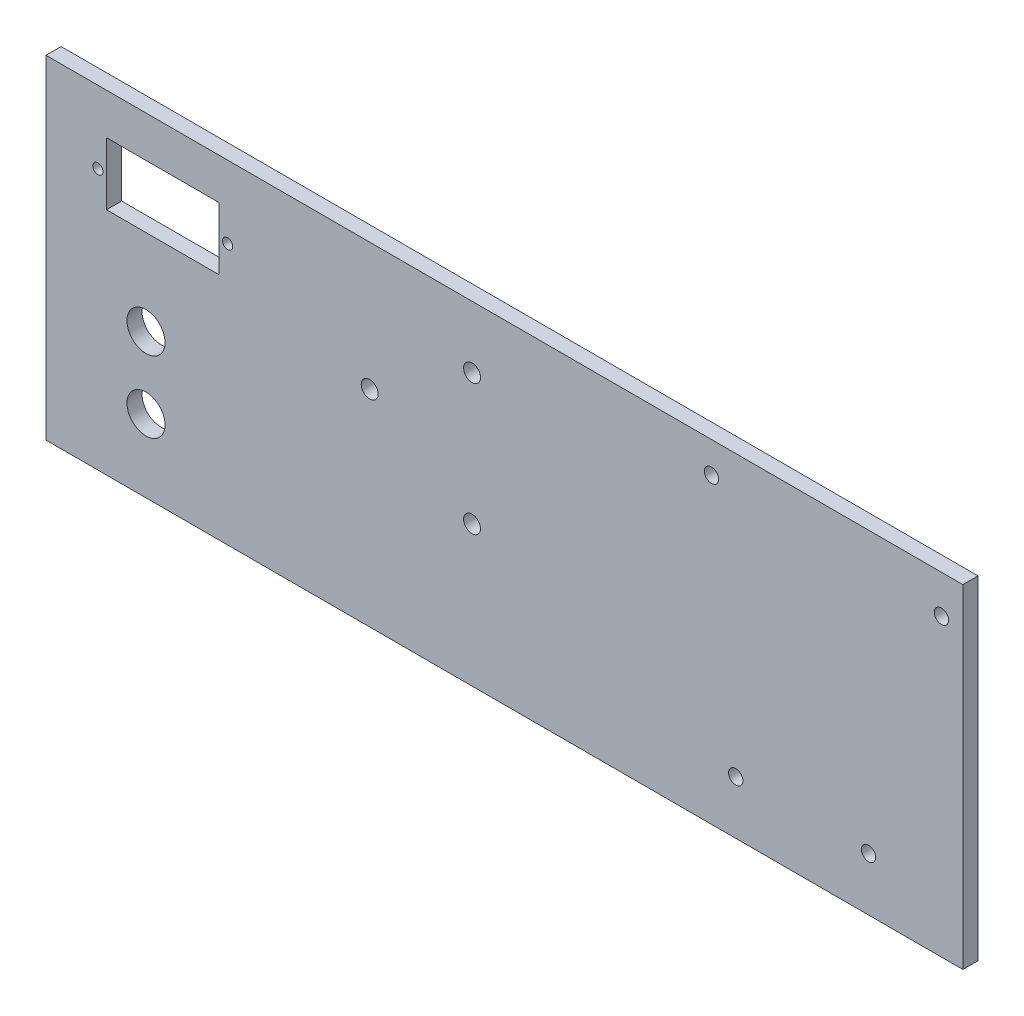
ISO-10303-21;
HEADER;
FILE_DESCRIPTION(('STEP AP214'),'2;1');
FILE_NAME('part.step','',(''),(''),'','','');
FILE_SCHEMA(('AUTOMOTIVE_DESIGN { 1 0 10303 214 1 1 1 1 }'));
ENDSEC;
DATA;
#1=APPLICATION_CONTEXT('core data for automotive mechanical design processes');
#2=APPLICATION_PROTOCOL_DEFINITION('international standard','automotive_design',2000,#1);
#3=PRODUCT_CONTEXT('',#1,'mechanical');
#4=PRODUCT('Part','Part','',(#3));
#5=PRODUCT_RELATED_PRODUCT_CATEGORY('part','',(#4));
#6=PRODUCT_DEFINITION_FORMATION('','',#4);
#7=PRODUCT_DEFINITION_CONTEXT('part definition',#1,'design');
#8=PRODUCT_DEFINITION('design','',#6,#7);
#9=PRODUCT_DEFINITION_SHAPE('','',#8);
#10=(LENGTH_UNIT() NAMED_UNIT(*) SI_UNIT(.MILLI.,.METRE.));
#11=(NAMED_UNIT(*) PLANE_ANGLE_UNIT() SI_UNIT($,.RADIAN.));
#12=(NAMED_UNIT(*) SI_UNIT($,.STERADIAN.) SOLID_ANGLE_UNIT());
#13=UNCERTAINTY_MEASURE_WITH_UNIT(LENGTH_MEASURE(1.E-05),#10,'distance_accuracy_value','');
#14=(GEOMETRIC_REPRESENTATION_CONTEXT(3) GLOBAL_UNCERTAINTY_ASSIGNED_CONTEXT((#13)) GLOBAL_UNIT_ASSIGNED_CONTEXT((#10,
#11,#12)) REPRESENTATION_CONTEXT('',''));
#15=CARTESIAN_POINT('',(0.,0.,0.));
#16=DIRECTION('',(0.,0.,1.));
#17=DIRECTION('',(1.,0.,0.));
#18=AXIS2_PLACEMENT_3D('',#15,#16,#17);
#19=CARTESIAN_POINT('',(63.7856191475757,70.,-73.));
#20=DIRECTION('',(0.,1.,0.));
#21=DIRECTION('',(1.,0.,0.));
#22=AXIS2_PLACEMENT_3D('',#19,#20,#21);
#23=PLANE('',#22);
#24=DIRECTION('',(1.,0.,0.));
#25=VECTOR('',#24,1.);
#26=CARTESIAN_POINT('',(63.7856191475757,70.,-73.));
#27=LINE('',#26,#25);
#28=CARTESIAN_POINT('',(0.,70.,-72.9999999999998));
#29=VERTEX_POINT('',#28);
#30=CARTESIAN_POINT('',(192.571238295151,70.,-73.0000000000004));
#31=VERTEX_POINT('',#30);
#32=EDGE_CURVE('E55',#29,#31,#27,.T.);
#33=ORIENTED_EDGE('',*,*,#32,.F.);
#34=DIRECTION('',(0.,0.,-1.));
#35=VECTOR('',#34,1.);
#36=CARTESIAN_POINT('',(0.,70.,-72.9999999999998));
#37=LINE('',#36,#35);
#38=CARTESIAN_POINT('',(0.,70.,-69.8199999999998));
#39=VERTEX_POINT('',#38);
#40=EDGE_CURVE('E190',#39,#29,#37,.T.);
#41=ORIENTED_EDGE('',*,*,#40,.F.);
#42=DIRECTION('',(-1.,0.,0.));
#43=VECTOR('',#42,1.);
#44=CARTESIAN_POINT('',(63.7856191475757,70.,-69.82));
#45=LINE('',#44,#43);
#46=CARTESIAN_POINT('',(192.571238295151,70.,-69.8200000000004));
#47=VERTEX_POINT('',#46);
#48=EDGE_CURVE('E82',#39,#47,#45,.F.);
#49=ORIENTED_EDGE('',*,*,#48,.T.);
#50=DIRECTION('',(0.,0.,-1.));
#51=VECTOR('',#50,1.);
#52=CARTESIAN_POINT('',(192.571238295151,70.,-73.0000000000004));
#53=LINE('',#52,#51);
#54=EDGE_CURVE('E205',#47,#31,#53,.T.);
#55=ORIENTED_EDGE('',*,*,#54,.T.);
#56=EDGE_LOOP('',(#33,#41,#49,#55));
#57=FACE_BOUND('',#56,.T.);
#58=ADVANCED_FACE('F45',(#57),#23,.T.);
#59=CARTESIAN_POINT('',(63.7856191475757,0.,-73.));
#60=DIRECTION('',(0.,1.,0.));
#61=DIRECTION('',(1.,0.,0.));
#62=AXIS2_PLACEMENT_3D('',#59,#60,#61);
#63=PLANE('',#62);
#64=DIRECTION('',(-1.,0.,0.));
#65=VECTOR('',#64,1.);
#66=CARTESIAN_POINT('',(63.7856191475757,0.,-69.82));
#67=LINE('',#66,#65);
#68=CARTESIAN_POINT('',(0.,0.,-69.8199999999998));
#69=VERTEX_POINT('',#68);
#70=CARTESIAN_POINT('',(192.571238295151,0.,-69.8200000000004));
#71=VERTEX_POINT('',#70);
#72=EDGE_CURVE('E12',#69,#71,#67,.F.);
#73=ORIENTED_EDGE('',*,*,#72,.F.);
#74=DIRECTION('',(0.,0.,-1.));
#75=VECTOR('',#74,1.);
#76=CARTESIAN_POINT('',(0.,0.,-72.9999999999998));
#77=LINE('',#76,#75);
#78=CARTESIAN_POINT('',(0.,0.,-72.9999999999998));
#79=VERTEX_POINT('',#78);
#80=EDGE_CURVE('E116',#69,#79,#77,.T.);
#81=ORIENTED_EDGE('',*,*,#80,.T.);
#82=DIRECTION('',(1.,0.,0.));
#83=VECTOR('',#82,1.);
#84=CARTESIAN_POINT('',(63.7856191475757,0.,-73.));
#85=LINE('',#84,#83);
#86=CARTESIAN_POINT('',(192.571238295151,0.,-73.0000000000004));
#87=VERTEX_POINT('',#86);
#88=EDGE_CURVE('E74',#79,#87,#85,.T.);
#89=ORIENTED_EDGE('',*,*,#88,.T.);
#90=DIRECTION('',(0.,0.,-1.));
#91=VECTOR('',#90,1.);
#92=CARTESIAN_POINT('',(192.571238295151,0.,-73.0000000000004));
#93=LINE('',#92,#91);
#94=EDGE_CURVE('E118',#71,#87,#93,.T.);
#95=ORIENTED_EDGE('',*,*,#94,.F.);
#96=EDGE_LOOP('',(#73,#81,#89,#95));
#97=FACE_BOUND('',#96,.T.);
#98=ADVANCED_FACE('F115',(#97),#63,.F.);
#99=CARTESIAN_POINT('',(0.,70.,-72.9999999999998));
#100=DIRECTION('',(0.,0.,-1.));
#101=DIRECTION('',(-1.,0.,0.));
#102=AXIS2_PLACEMENT_3D('',#99,#100,#101);
#103=PLANE('',#102);
#104=CARTESIAN_POINT('',(67.9856191475758,43.25,-73.));
#105=DIRECTION('',(0.,0.,-1.));
#106=DIRECTION('',(-1.,0.,0.));
#107=AXIS2_PLACEMENT_3D('',#104,#105,#106);
#108=CIRCLE('',#107,1.77799999999999);
#109=CARTESIAN_POINT('',(66.2076191475759,43.25,-73.));
#110=VERTEX_POINT('',#109);
#111=EDGE_CURVE('E223',#110,#110,#108,.T.);
#112=ORIENTED_EDGE('',*,*,#111,.F.);
#113=EDGE_LOOP('',(#112));
#114=FACE_BOUND('',#113,.T.);
#115=CARTESIAN_POINT('',(89.4856191475758,57.,-73.0000000000001));
#116=DIRECTION('',(0.,0.,-1.));
#117=DIRECTION('',(-1.,0.,0.));
#118=AXIS2_PLACEMENT_3D('',#115,#116,#117);
#119=CIRCLE('',#118,1.77799999999999);
#120=CARTESIAN_POINT('',(87.7076191475758,57.,-73.0000000000001));
#121=VERTEX_POINT('',#120);
#122=EDGE_CURVE('E227',#121,#121,#119,.T.);
#123=ORIENTED_EDGE('',*,*,#122,.F.);
#124=EDGE_LOOP('',(#123));
#125=FACE_BOUND('',#124,.T.);
#126=CARTESIAN_POINT('',(89.4856191475758,29.5,-73.0000000000001));
#127=DIRECTION('',(0.,0.,-1.));
#128=DIRECTION('',(-1.,0.,0.));
#129=AXIS2_PLACEMENT_3D('',#126,#127,#128);
#130=CIRCLE('',#129,1.778);
#131=CARTESIAN_POINT('',(87.7076191475758,29.5,-73.0000000000001));
#132=VERTEX_POINT('',#131);
#133=EDGE_CURVE('E195',#132,#132,#130,.T.);
#134=ORIENTED_EDGE('',*,*,#133,.F.);
#135=EDGE_LOOP('',(#134));
#136=FACE_BOUND('',#135,.T.);
#137=ORIENTED_EDGE('',*,*,#88,.F.);
#138=DIRECTION('',(0.,-1.,0.));
#139=VECTOR('',#138,1.);
#140=CARTESIAN_POINT('',(0.,70.,-72.9999999999998));
#141=LINE('',#140,#139);
#142=EDGE_CURVE('E125',#29,#79,#141,.T.);
#143=ORIENTED_EDGE('',*,*,#142,.F.);
#144=ORIENTED_EDGE('',*,*,#32,.T.);
#145=DIRECTION('',(0.,-1.,0.));
#146=VECTOR('',#145,1.);
#147=CARTESIAN_POINT('',(192.571238295151,70.,-73.0000000000004));
#148=LINE('',#147,#146);
#149=EDGE_CURVE('E207',#31,#87,#148,.T.);
#150=ORIENTED_EDGE('',*,*,#149,.T.);
#151=EDGE_LOOP('',(#137,#143,#144,#150));
#152=FACE_BOUND('',#151,.T.);
#153=CARTESIAN_POINT('',(188.071238295151,62.,-73.0000000000004));
#154=DIRECTION('',(0.,0.,-1.));
#155=DIRECTION('',(-1.,0.,0.));
#156=AXIS2_PLACEMENT_3D('',#153,#154,#155);
#157=CIRCLE('',#156,1.5);
#158=CARTESIAN_POINT('',(186.571238295151,62.,-73.0000000000004));
#159=VERTEX_POINT('',#158);
#160=EDGE_CURVE('E210',#159,#159,#157,.T.);
#161=ORIENTED_EDGE('',*,*,#160,.F.);
#162=EDGE_LOOP('',(#161));
#163=FACE_BOUND('',#162,.T.);
#164=CARTESIAN_POINT('',(144.871238295151,11.2,-73.0000000000003));
#165=DIRECTION('',(0.,0.,-1.));
#166=DIRECTION('',(-1.,0.,0.));
#167=AXIS2_PLACEMENT_3D('',#164,#165,#166);
#168=CIRCLE('',#167,1.5);
#169=CARTESIAN_POINT('',(143.371238295151,11.2,-73.0000000000003));
#170=VERTEX_POINT('',#169);
#171=EDGE_CURVE('E213',#170,#170,#168,.T.);
#172=ORIENTED_EDGE('',*,*,#171,.F.);
#173=EDGE_LOOP('',(#172));
#174=FACE_BOUND('',#173,.T.);
#175=CARTESIAN_POINT('',(139.771238295151,63.5,-73.0000000000003));
#176=DIRECTION('',(0.,0.,-1.));
#177=DIRECTION('',(-1.,0.,0.));
#178=AXIS2_PLACEMENT_3D('',#175,#176,#177);
#179=CIRCLE('',#178,1.5);
#180=CARTESIAN_POINT('',(138.271238295151,63.5,-73.0000000000003));
#181=VERTEX_POINT('',#180);
#182=EDGE_CURVE('E216',#181,#181,#179,.T.);
#183=ORIENTED_EDGE('',*,*,#182,.F.);
#184=EDGE_LOOP('',(#183));
#185=FACE_BOUND('',#184,.T.);
#186=CARTESIAN_POINT('',(172.771238295151,11.2,-73.0000000000004));
#187=DIRECTION('',(0.,0.,-1.));
#188=DIRECTION('',(-1.,0.,0.));
#189=AXIS2_PLACEMENT_3D('',#186,#187,#188);
#190=CIRCLE('',#189,1.5);
#191=CARTESIAN_POINT('',(171.271238295151,11.2,-73.0000000000004));
#192=VERTEX_POINT('',#191);
#193=EDGE_CURVE('E219',#192,#192,#190,.T.);
#194=ORIENTED_EDGE('',*,*,#193,.F.);
#195=EDGE_LOOP('',(#194));
#196=FACE_BOUND('',#195,.T.);
#197=CARTESIAN_POINT('',(38.1430257973656,54.8143121186807,-72.9999999999999));
#198=DIRECTION('',(0.,0.,-1.));
#199=DIRECTION('',(-1.,0.,0.));
#200=AXIS2_PLACEMENT_3D('',#197,#198,#199);
#201=CIRCLE('',#200,1.075);
#202=CARTESIAN_POINT('',(37.0680257973656,54.8143121186807,-72.9999999999999));
#203=VERTEX_POINT('',#202);
#204=EDGE_CURVE('E127',#203,#203,#201,.T.);
#205=ORIENTED_EDGE('',*,*,#204,.F.);
#206=EDGE_LOOP('',(#205));
#207=FACE_BOUND('',#206,.T.);
#208=CARTESIAN_POINT('',(10.8930257973656,54.8143121186807,-72.9999999999998));
#209=DIRECTION('',(0.,0.,-1.));
#210=DIRECTION('',(-1.,0.,0.));
#211=AXIS2_PLACEMENT_3D('',#208,#209,#210);
#212=CIRCLE('',#211,1.075);
#213=CARTESIAN_POINT('',(9.81802579736561,54.8143121186807,-72.9999999999998));
#214=VERTEX_POINT('',#213);
#215=EDGE_CURVE('E160',#214,#214,#212,.T.);
#216=ORIENTED_EDGE('',*,*,#215,.F.);
#217=EDGE_LOOP('',(#216));
#218=FACE_BOUND('',#217,.T.);
#219=DIRECTION('',(1.,0.,0.));
#220=VECTOR('',#219,1.);
#221=CARTESIAN_POINT('',(12.7060257973656,61.3763121186807,-72.9999999999999));
#222=LINE('',#221,#220);
#223=CARTESIAN_POINT('',(12.7060257973656,61.3763121186807,-72.9999999999999));
#224=VERTEX_POINT('',#223);
#225=CARTESIAN_POINT('',(36.3300257973656,61.3763121186807,-72.9999999999999));
#226=VERTEX_POINT('',#225);
#227=EDGE_CURVE('E163',#224,#226,#222,.T.);
#228=ORIENTED_EDGE('',*,*,#227,.F.);
#229=DIRECTION('',(0.,1.,0.));
#230=VECTOR('',#229,1.);
#231=CARTESIAN_POINT('',(12.7060257973656,61.3763121186807,-72.9999999999999));
#232=LINE('',#231,#230);
#233=CARTESIAN_POINT('',(12.7060257973656,48.2523121186807,-72.9999999999999));
#234=VERTEX_POINT('',#233);
#235=EDGE_CURVE('E167',#234,#224,#232,.T.);
#236=ORIENTED_EDGE('',*,*,#235,.F.);
#237=DIRECTION('',(-1.,0.,0.));
#238=VECTOR('',#237,1.);
#239=CARTESIAN_POINT('',(12.7060257973656,48.2523121186807,-72.9999999999999));
#240=LINE('',#239,#238);
#241=CARTESIAN_POINT('',(36.3300257973656,48.2523121186807,-72.9999999999999));
#242=VERTEX_POINT('',#241);
#243=EDGE_CURVE('E172',#242,#234,#240,.T.);
#244=ORIENTED_EDGE('',*,*,#243,.F.);
#245=DIRECTION('',(0.,-1.,0.));
#246=VECTOR('',#245,1.);
#247=CARTESIAN_POINT('',(36.3300257973656,61.3763121186807,-72.9999999999999));
#248=LINE('',#247,#246);
#249=EDGE_CURVE('E177',#226,#242,#248,.T.);
#250=ORIENTED_EDGE('',*,*,#249,.F.);
#251=EDGE_LOOP('',(#228,#236,#244,#250));
#252=FACE_BOUND('',#251,.T.);
#253=CARTESIAN_POINT('',(21.,15.25,-72.9999999999999));
#254=DIRECTION('',(0.,0.,-1.));
#255=DIRECTION('',(-1.,0.,0.));
#256=AXIS2_PLACEMENT_3D('',#253,#254,#255);
#257=CIRCLE('',#256,4.);
#258=CARTESIAN_POINT('',(17.,15.25,-72.9999999999999));
#259=VERTEX_POINT('',#258);
#260=EDGE_CURVE('E183',#259,#259,#257,.T.);
#261=ORIENTED_EDGE('',*,*,#260,.F.);
#262=EDGE_LOOP('',(#261));
#263=FACE_BOUND('',#262,.T.);
#264=CARTESIAN_POINT('',(21.0000007040894,30.25,-72.9999999999999));
#265=DIRECTION('',(0.,0.,-1.));
#266=DIRECTION('',(-1.,0.,0.));
#267=AXIS2_PLACEMENT_3D('',#264,#265,#266);
#268=CIRCLE('',#267,4.);
#269=CARTESIAN_POINT('',(17.0000007040894,30.25,-72.9999999999999));
#270=VERTEX_POINT('',#269);
#271=EDGE_CURVE('E186',#270,#270,#268,.T.);
#272=ORIENTED_EDGE('',*,*,#271,.F.);
#273=EDGE_LOOP('',(#272));
#274=FACE_BOUND('',#273,.T.);
#275=ADVANCED_FACE('F47',(#114,#125,#136,#152,#163,#174,#185,#196,#207,#218,#252,#263,#274),
#103,.T.);
#276=CARTESIAN_POINT('',(63.7856191475757,70.,-69.82));
#277=DIRECTION('',(0.,0.,-1.));
#278=DIRECTION('',(-1.,0.,0.));
#279=AXIS2_PLACEMENT_3D('',#276,#277,#278);
#280=PLANE('',#279);
#281=CARTESIAN_POINT('',(67.9856191475758,43.25,-69.82));
#282=DIRECTION('',(0.,0.,-1.));
#283=DIRECTION('',(-1.,0.,0.));
#284=AXIS2_PLACEMENT_3D('',#281,#282,#283);
#285=CIRCLE('',#284,1.77799999999999);
#286=CARTESIAN_POINT('',(66.2076191475759,43.25,-69.82));
#287=VERTEX_POINT('',#286);
#288=EDGE_CURVE('E49',#287,#287,#285,.T.);
#289=ORIENTED_EDGE('',*,*,#288,.T.);
#290=EDGE_LOOP('',(#289));
#291=FACE_BOUND('',#290,.T.);
#292=CARTESIAN_POINT('',(89.4856191475758,57.,-69.8200000000001));
#293=DIRECTION('',(0.,0.,-1.));
#294=DIRECTION('',(-1.,0.,0.));
#295=AXIS2_PLACEMENT_3D('',#292,#293,#294);
#296=CIRCLE('',#295,1.77799999999999);
#297=CARTESIAN_POINT('',(87.7076191475759,57.,-69.8200000000001));
#298=VERTEX_POINT('',#297);
#299=EDGE_CURVE('E236',#298,#298,#296,.T.);
#300=ORIENTED_EDGE('',*,*,#299,.T.);
#301=EDGE_LOOP('',(#300));
#302=FACE_BOUND('',#301,.T.);
#303=CARTESIAN_POINT('',(89.4856191475758,29.5,-69.8200000000001));
#304=DIRECTION('',(0.,0.,-1.));
#305=DIRECTION('',(-1.,0.,0.));
#306=AXIS2_PLACEMENT_3D('',#303,#304,#305);
#307=CIRCLE('',#306,1.778);
#308=CARTESIAN_POINT('',(87.7076191475758,29.5,-69.8200000000001));
#309=VERTEX_POINT('',#308);
#310=EDGE_CURVE('E226',#309,#309,#307,.T.);
#311=ORIENTED_EDGE('',*,*,#310,.T.);
#312=EDGE_LOOP('',(#311));
#313=FACE_BOUND('',#312,.T.);
#314=ORIENTED_EDGE('',*,*,#72,.T.);
#315=DIRECTION('',(0.,1.,0.));
#316=VECTOR('',#315,1.);
#317=CARTESIAN_POINT('',(192.571238295151,70.,-69.8200000000004));
#318=LINE('',#317,#316);
#319=EDGE_CURVE('E131',#47,#71,#318,.F.);
#320=ORIENTED_EDGE('',*,*,#319,.F.);
#321=ORIENTED_EDGE('',*,*,#48,.F.);
#322=DIRECTION('',(0.,1.,0.));
#323=VECTOR('',#322,1.);
#324=CARTESIAN_POINT('',(0.,70.,-69.8199999999998));
#325=LINE('',#324,#323);
#326=EDGE_CURVE('E123',#39,#69,#325,.F.);
#327=ORIENTED_EDGE('',*,*,#326,.T.);
#328=EDGE_LOOP('',(#314,#320,#321,#327));
#329=FACE_BOUND('',#328,.T.);
#330=CARTESIAN_POINT('',(188.071238295151,62.,-69.8200000000004));
#331=DIRECTION('',(0.,0.,-1.));
#332=DIRECTION('',(-1.,0.,0.));
#333=AXIS2_PLACEMENT_3D('',#330,#331,#332);
#334=CIRCLE('',#333,1.5);
#335=CARTESIAN_POINT('',(186.571238295151,62.,-69.8200000000004));
#336=VERTEX_POINT('',#335);
#337=EDGE_CURVE('E202',#336,#336,#334,.T.);
#338=ORIENTED_EDGE('',*,*,#337,.T.);
#339=EDGE_LOOP('',(#338));
#340=FACE_BOUND('',#339,.T.);
#341=CARTESIAN_POINT('',(144.871238295151,11.2,-69.8200000000003));
#342=DIRECTION('',(0.,0.,-1.));
#343=DIRECTION('',(-1.,0.,0.));
#344=AXIS2_PLACEMENT_3D('',#341,#342,#343);
#345=CIRCLE('',#344,1.5);
#346=CARTESIAN_POINT('',(143.371238295151,11.2,-69.8200000000003));
#347=VERTEX_POINT('',#346);
#348=EDGE_CURVE('E199',#347,#347,#345,.T.);
#349=ORIENTED_EDGE('',*,*,#348,.T.);
#350=EDGE_LOOP('',(#349));
#351=FACE_BOUND('',#350,.T.);
#352=CARTESIAN_POINT('',(139.771238295151,63.5,-69.8200000000003));
#353=DIRECTION('',(0.,0.,-1.));
#354=DIRECTION('',(-1.,0.,0.));
#355=AXIS2_PLACEMENT_3D('',#352,#353,#354);
#356=CIRCLE('',#355,1.5);
#357=CARTESIAN_POINT('',(138.271238295151,63.5,-69.8200000000003));
#358=VERTEX_POINT('',#357);
#359=EDGE_CURVE('E196',#358,#358,#356,.T.);
#360=ORIENTED_EDGE('',*,*,#359,.T.);
#361=EDGE_LOOP('',(#360));
#362=FACE_BOUND('',#361,.T.);
#363=CARTESIAN_POINT('',(172.771238295151,11.2,-69.8200000000003));
#364=DIRECTION('',(0.,0.,-1.));
#365=DIRECTION('',(-1.,0.,0.));
#366=AXIS2_PLACEMENT_3D('',#363,#364,#365);
#367=CIRCLE('',#366,1.5);
#368=CARTESIAN_POINT('',(171.271238295151,11.2,-69.8200000000003));
#369=VERTEX_POINT('',#368);
#370=EDGE_CURVE('E192',#369,#369,#367,.T.);
#371=ORIENTED_EDGE('',*,*,#370,.T.);
#372=EDGE_LOOP('',(#371));
#373=FACE_BOUND('',#372,.T.);
#374=CARTESIAN_POINT('',(38.1430257973656,54.8143121186807,-69.8199999999999));
#375=DIRECTION('',(0.,0.,-1.));
#376=DIRECTION('',(-1.,0.,0.));
#377=AXIS2_PLACEMENT_3D('',#374,#375,#376);
#378=CIRCLE('',#377,1.075);
#379=CARTESIAN_POINT('',(37.0680257973656,54.8143121186807,-69.8199999999999));
#380=VERTEX_POINT('',#379);
#381=EDGE_CURVE('E126',#380,#380,#378,.T.);
#382=ORIENTED_EDGE('',*,*,#381,.T.);
#383=EDGE_LOOP('',(#382));
#384=FACE_BOUND('',#383,.T.);
#385=CARTESIAN_POINT('',(10.8930257973656,54.8143121186807,-69.8199999999998));
#386=DIRECTION('',(0.,0.,-1.));
#387=DIRECTION('',(-1.,0.,0.));
#388=AXIS2_PLACEMENT_3D('',#385,#386,#387);
#389=CIRCLE('',#388,1.075);
#390=CARTESIAN_POINT('',(9.81802579736562,54.8143121186807,-69.8199999999998));
#391=VERTEX_POINT('',#390);
#392=EDGE_CURVE('E153',#391,#391,#389,.T.);
#393=ORIENTED_EDGE('',*,*,#392,.T.);
#394=EDGE_LOOP('',(#393));
#395=FACE_BOUND('',#394,.T.);
#396=DIRECTION('',(0.,1.,0.));
#397=VECTOR('',#396,1.);
#398=CARTESIAN_POINT('',(12.7060257973656,70.,-69.8199999999999));
#399=LINE('',#398,#397);
#400=CARTESIAN_POINT('',(12.7060257973656,48.2523121186807,-69.8199999999999));
#401=VERTEX_POINT('',#400);
#402=CARTESIAN_POINT('',(12.7060257973656,61.3763121186807,-69.8199999999999));
#403=VERTEX_POINT('',#402);
#404=EDGE_CURVE('E150',#401,#403,#399,.T.);
#405=ORIENTED_EDGE('',*,*,#404,.T.);
#406=DIRECTION('',(1.,0.,0.));
#407=VECTOR('',#406,1.);
#408=CARTESIAN_POINT('',(0.,61.3763121186807,-69.8199999999998));
#409=LINE('',#408,#407);
#410=CARTESIAN_POINT('',(36.3300257973656,61.3763121186807,-69.8199999999999));
#411=VERTEX_POINT('',#410);
#412=EDGE_CURVE('E147',#403,#411,#409,.T.);
#413=ORIENTED_EDGE('',*,*,#412,.T.);
#414=DIRECTION('',(0.,-1.,0.));
#415=VECTOR('',#414,1.);
#416=CARTESIAN_POINT('',(36.3300257973656,70.,-69.8199999999999));
#417=LINE('',#416,#415);
#418=CARTESIAN_POINT('',(36.3300257973656,48.2523121186807,-69.8199999999999));
#419=VERTEX_POINT('',#418);
#420=EDGE_CURVE('E144',#411,#419,#417,.T.);
#421=ORIENTED_EDGE('',*,*,#420,.T.);
#422=DIRECTION('',(-1.,0.,0.));
#423=VECTOR('',#422,1.);
#424=CARTESIAN_POINT('',(0.,48.2523121186807,-69.8199999999998));
#425=LINE('',#424,#423);
#426=EDGE_CURVE('E141',#419,#401,#425,.T.);
#427=ORIENTED_EDGE('',*,*,#426,.T.);
#428=EDGE_LOOP('',(#405,#413,#421,#427));
#429=FACE_BOUND('',#428,.T.);
#430=CARTESIAN_POINT('',(21.,15.25,-69.8199999999999));
#431=DIRECTION('',(0.,0.,-1.));
#432=DIRECTION('',(-1.,0.,0.));
#433=AXIS2_PLACEMENT_3D('',#430,#431,#432);
#434=CIRCLE('',#433,4.);
#435=CARTESIAN_POINT('',(17.,15.25,-69.8199999999999));
#436=VERTEX_POINT('',#435);
#437=EDGE_CURVE('E136',#436,#436,#434,.T.);
#438=ORIENTED_EDGE('',*,*,#437,.T.);
#439=EDGE_LOOP('',(#438));
#440=FACE_BOUND('',#439,.T.);
#441=CARTESIAN_POINT('',(21.0000007040894,30.25,-69.8199999999999));
#442=DIRECTION('',(0.,0.,-1.));
#443=DIRECTION('',(-1.,0.,0.));
#444=AXIS2_PLACEMENT_3D('',#441,#442,#443);
#445=CIRCLE('',#444,4.);
#446=CARTESIAN_POINT('',(17.0000007040894,30.25,-69.8199999999999));
#447=VERTEX_POINT('',#446);
#448=EDGE_CURVE('E132',#447,#447,#445,.T.);
#449=ORIENTED_EDGE('',*,*,#448,.T.);
#450=EDGE_LOOP('',(#449));
#451=FACE_BOUND('',#450,.T.);
#452=ADVANCED_FACE('F129',(#291,#302,#313,#329,#340,#351,#362,#373,#384,#395,#429,#440,#451),
#280,.F.);
#453=CARTESIAN_POINT('',(89.4856191475759,29.5,-63.0000000000001));
#454=DIRECTION('',(0.,0.,-1.));
#455=DIRECTION('',(-1.,0.,0.));
#456=AXIS2_PLACEMENT_3D('',#453,#454,#455);
#457=CYLINDRICAL_SURFACE('',#456,1.778);
#458=ORIENTED_EDGE('',*,*,#133,.T.);
#459=EDGE_LOOP('',(#458));
#460=FACE_BOUND('',#459,.T.);
#461=ORIENTED_EDGE('',*,*,#310,.F.);
#462=EDGE_LOOP('',(#461));
#463=FACE_BOUND('',#462,.T.);
#464=ADVANCED_FACE('F257',(#460,#463),#457,.F.);
#465=CARTESIAN_POINT('',(89.4856191475759,57.,-63.0000000000001));
#466=DIRECTION('',(0.,0.,-1.));
#467=DIRECTION('',(-1.,0.,0.));
#468=AXIS2_PLACEMENT_3D('',#465,#466,#467);
#469=CYLINDRICAL_SURFACE('',#468,1.77799999999999);
#470=ORIENTED_EDGE('',*,*,#122,.T.);
#471=EDGE_LOOP('',(#470));
#472=FACE_BOUND('',#471,.T.);
#473=ORIENTED_EDGE('',*,*,#299,.F.);
#474=EDGE_LOOP('',(#473));
#475=FACE_BOUND('',#474,.T.);
#476=ADVANCED_FACE('F247',(#472,#475),#469,.F.);
#477=CARTESIAN_POINT('',(67.9856191475759,43.25,-63.));
#478=DIRECTION('',(0.,0.,-1.));
#479=DIRECTION('',(-1.,0.,0.));
#480=AXIS2_PLACEMENT_3D('',#477,#478,#479);
#481=CYLINDRICAL_SURFACE('',#480,1.77799999999999);
#482=ORIENTED_EDGE('',*,*,#111,.T.);
#483=EDGE_LOOP('',(#482));
#484=FACE_BOUND('',#483,.T.);
#485=ORIENTED_EDGE('',*,*,#288,.F.);
#486=EDGE_LOOP('',(#485));
#487=FACE_BOUND('',#486,.T.);
#488=ADVANCED_FACE('F244',(#484,#487),#481,.F.);
#489=CARTESIAN_POINT('',(192.571238295151,70.,-73.0000000000004));
#490=DIRECTION('',(1.,0.,0.));
#491=DIRECTION('',(0.,-1.,0.));
#492=AXIS2_PLACEMENT_3D('',#489,#490,#491);
#493=PLANE('',#492);
#494=ORIENTED_EDGE('',*,*,#54,.F.);
#495=ORIENTED_EDGE('',*,*,#319,.T.);
#496=ORIENTED_EDGE('',*,*,#94,.T.);
#497=ORIENTED_EDGE('',*,*,#149,.F.);
#498=EDGE_LOOP('',(#494,#495,#496,#497));
#499=FACE_BOUND('',#498,.T.);
#500=ADVANCED_FACE('F246',(#499),#493,.T.);
#501=CARTESIAN_POINT('',(172.771238295151,11.2,-73.0000000000004));
#502=DIRECTION('',(0.,0.,-1.));
#503=DIRECTION('',(-1.,0.,0.));
#504=AXIS2_PLACEMENT_3D('',#501,#502,#503);
#505=CYLINDRICAL_SURFACE('',#504,1.5);
#506=ORIENTED_EDGE('',*,*,#193,.T.);
#507=EDGE_LOOP('',(#506));
#508=FACE_BOUND('',#507,.T.);
#509=ORIENTED_EDGE('',*,*,#370,.F.);
#510=EDGE_LOOP('',(#509));
#511=FACE_BOUND('',#510,.T.);
#512=ADVANCED_FACE('F254',(#508,#511),#505,.F.);
#513=CARTESIAN_POINT('',(139.771238295151,63.5,-73.0000000000003));
#514=DIRECTION('',(0.,0.,-1.));
#515=DIRECTION('',(-1.,0.,0.));
#516=AXIS2_PLACEMENT_3D('',#513,#514,#515);
#517=CYLINDRICAL_SURFACE('',#516,1.5);
#518=ORIENTED_EDGE('',*,*,#182,.T.);
#519=EDGE_LOOP('',(#518));
#520=FACE_BOUND('',#519,.T.);
#521=ORIENTED_EDGE('',*,*,#359,.F.);
#522=EDGE_LOOP('',(#521));
#523=FACE_BOUND('',#522,.T.);
#524=ADVANCED_FACE('F346',(#520,#523),#517,.F.);
#525=CARTESIAN_POINT('',(144.871238295151,11.2,-73.0000000000003));
#526=DIRECTION('',(0.,0.,-1.));
#527=DIRECTION('',(-1.,0.,0.));
#528=AXIS2_PLACEMENT_3D('',#525,#526,#527);
#529=CYLINDRICAL_SURFACE('',#528,1.5);
#530=ORIENTED_EDGE('',*,*,#171,.T.);
#531=EDGE_LOOP('',(#530));
#532=FACE_BOUND('',#531,.T.);
#533=ORIENTED_EDGE('',*,*,#348,.F.);
#534=EDGE_LOOP('',(#533));
#535=FACE_BOUND('',#534,.T.);
#536=ADVANCED_FACE('F350',(#532,#535),#529,.F.);
#537=CARTESIAN_POINT('',(188.071238295151,62.,-73.0000000000004));
#538=DIRECTION('',(0.,0.,-1.));
#539=DIRECTION('',(-1.,0.,0.));
#540=AXIS2_PLACEMENT_3D('',#537,#538,#539);
#541=CYLINDRICAL_SURFACE('',#540,1.5);
#542=ORIENTED_EDGE('',*,*,#160,.T.);
#543=EDGE_LOOP('',(#542));
#544=FACE_BOUND('',#543,.T.);
#545=ORIENTED_EDGE('',*,*,#337,.F.);
#546=EDGE_LOOP('',(#545));
#547=FACE_BOUND('',#546,.T.);
#548=ADVANCED_FACE('F318',(#544,#547),#541,.F.);
#549=CARTESIAN_POINT('',(0.,70.,-72.9999999999998));
#550=DIRECTION('',(1.,0.,0.));
#551=DIRECTION('',(0.,-1.,0.));
#552=AXIS2_PLACEMENT_3D('',#549,#550,#551);
#553=PLANE('',#552);
#554=ORIENTED_EDGE('',*,*,#80,.F.);
#555=ORIENTED_EDGE('',*,*,#326,.F.);
#556=ORIENTED_EDGE('',*,*,#40,.T.);
#557=ORIENTED_EDGE('',*,*,#142,.T.);
#558=EDGE_LOOP('',(#554,#555,#556,#557));
#559=FACE_BOUND('',#558,.T.);
#560=ADVANCED_FACE('F122',(#559),#553,.F.);
#561=CARTESIAN_POINT('',(21.0000007040894,30.25,-62.9999999999999));
#562=DIRECTION('',(0.,0.,-1.));
#563=DIRECTION('',(-1.,0.,0.));
#564=AXIS2_PLACEMENT_3D('',#561,#562,#563);
#565=CYLINDRICAL_SURFACE('',#564,4.);
#566=ORIENTED_EDGE('',*,*,#271,.T.);
#567=EDGE_LOOP('',(#566));
#568=FACE_BOUND('',#567,.T.);
#569=ORIENTED_EDGE('',*,*,#448,.F.);
#570=EDGE_LOOP('',(#569));
#571=FACE_BOUND('',#570,.T.);
#572=ADVANCED_FACE('F304',(#568,#571),#565,.F.);
#573=CARTESIAN_POINT('',(21.,15.25,-62.9999999999999));
#574=DIRECTION('',(0.,0.,-1.));
#575=DIRECTION('',(-1.,0.,0.));
#576=AXIS2_PLACEMENT_3D('',#573,#574,#575);
#577=CYLINDRICAL_SURFACE('',#576,4.);
#578=ORIENTED_EDGE('',*,*,#260,.T.);
#579=EDGE_LOOP('',(#578));
#580=FACE_BOUND('',#579,.T.);
#581=ORIENTED_EDGE('',*,*,#437,.F.);
#582=EDGE_LOOP('',(#581));
#583=FACE_BOUND('',#582,.T.);
#584=ADVANCED_FACE('F307',(#580,#583),#577,.F.);
#585=CARTESIAN_POINT('',(36.3300257973656,61.3763121186807,-62.9999999999999));
#586=DIRECTION('',(1.,0.,0.));
#587=DIRECTION('',(0.,0.,-1.));
#588=AXIS2_PLACEMENT_3D('',#585,#586,#587);
#589=PLANE('',#588);
#590=DIRECTION('',(0.,0.,-1.));
#591=VECTOR('',#590,1.);
#592=CARTESIAN_POINT('',(36.3300257973656,61.3763121186807,-62.9999999999999));
#593=LINE('',#592,#591);
#594=EDGE_CURVE('E180',#411,#226,#593,.T.);
#595=ORIENTED_EDGE('',*,*,#594,.T.);
#596=ORIENTED_EDGE('',*,*,#249,.T.);
#597=DIRECTION('',(0.,0.,-1.));
#598=VECTOR('',#597,1.);
#599=CARTESIAN_POINT('',(36.3300257973656,48.2523121186807,-62.9999999999999));
#600=LINE('',#599,#598);
#601=EDGE_CURVE('E175',#419,#242,#600,.T.);
#602=ORIENTED_EDGE('',*,*,#601,.F.);
#603=ORIENTED_EDGE('',*,*,#420,.F.);
#604=EDGE_LOOP('',(#595,#596,#602,#603));
#605=FACE_BOUND('',#604,.T.);
#606=ADVANCED_FACE('F315',(#605),#589,.F.);
#607=CARTESIAN_POINT('',(12.7060257973657,48.2523121186807,-62.9999999999999));
#608=DIRECTION('',(0.,-1.,0.));
#609=DIRECTION('',(0.,0.,-1.));
#610=AXIS2_PLACEMENT_3D('',#607,#608,#609);
#611=PLANE('',#610);
#612=ORIENTED_EDGE('',*,*,#601,.T.);
#613=ORIENTED_EDGE('',*,*,#243,.T.);
#614=DIRECTION('',(0.,0.,-1.));
#615=VECTOR('',#614,1.);
#616=CARTESIAN_POINT('',(12.7060257973657,48.2523121186807,-62.9999999999999));
#617=LINE('',#616,#615);
#618=EDGE_CURVE('E170',#401,#234,#617,.T.);
#619=ORIENTED_EDGE('',*,*,#618,.F.);
#620=ORIENTED_EDGE('',*,*,#426,.F.);
#621=EDGE_LOOP('',(#612,#613,#619,#620));
#622=FACE_BOUND('',#621,.T.);
#623=ADVANCED_FACE('F323',(#622),#611,.F.);
#624=CARTESIAN_POINT('',(12.7060257973657,61.3763121186807,-62.9999999999999));
#625=DIRECTION('',(-1.,0.,0.));
#626=DIRECTION('',(0.,0.,1.));
#627=AXIS2_PLACEMENT_3D('',#624,#625,#626);
#628=PLANE('',#627);
#629=ORIENTED_EDGE('',*,*,#618,.T.);
#630=ORIENTED_EDGE('',*,*,#235,.T.);
#631=DIRECTION('',(0.,0.,-1.));
#632=VECTOR('',#631,1.);
#633=CARTESIAN_POINT('',(12.7060257973657,61.3763121186807,-62.9999999999999));
#634=LINE('',#633,#632);
#635=EDGE_CURVE('E165',#403,#224,#634,.T.);
#636=ORIENTED_EDGE('',*,*,#635,.F.);
#637=ORIENTED_EDGE('',*,*,#404,.F.);
#638=EDGE_LOOP('',(#629,#630,#636,#637));
#639=FACE_BOUND('',#638,.T.);
#640=ADVANCED_FACE('F327',(#639),#628,.F.);
#641=CARTESIAN_POINT('',(12.7060257973657,61.3763121186807,-62.9999999999999));
#642=DIRECTION('',(0.,1.,0.));
#643=DIRECTION('',(0.,0.,1.));
#644=AXIS2_PLACEMENT_3D('',#641,#642,#643);
#645=PLANE('',#644);
#646=ORIENTED_EDGE('',*,*,#635,.T.);
#647=ORIENTED_EDGE('',*,*,#227,.T.);
#648=ORIENTED_EDGE('',*,*,#594,.F.);
#649=ORIENTED_EDGE('',*,*,#412,.F.);
#650=EDGE_LOOP('',(#646,#647,#648,#649));
#651=FACE_BOUND('',#650,.T.);
#652=ADVANCED_FACE('F331',(#651),#645,.F.);
#653=CARTESIAN_POINT('',(10.8930257973656,54.8143121186807,-62.9999999999999));
#654=DIRECTION('',(0.,0.,-1.));
#655=DIRECTION('',(-1.,0.,0.));
#656=AXIS2_PLACEMENT_3D('',#653,#654,#655);
#657=CYLINDRICAL_SURFACE('',#656,1.075);
#658=ORIENTED_EDGE('',*,*,#215,.T.);
#659=EDGE_LOOP('',(#658));
#660=FACE_BOUND('',#659,.T.);
#661=ORIENTED_EDGE('',*,*,#392,.F.);
#662=EDGE_LOOP('',(#661));
#663=FACE_BOUND('',#662,.T.);
#664=ADVANCED_FACE('F335',(#660,#663),#657,.F.);
#665=CARTESIAN_POINT('',(38.1430257973656,54.8143121186807,-62.9999999999999));
#666=DIRECTION('',(0.,0.,-1.));
#667=DIRECTION('',(-1.,0.,0.));
#668=AXIS2_PLACEMENT_3D('',#665,#666,#667);
#669=CYLINDRICAL_SURFACE('',#668,1.075);
#670=ORIENTED_EDGE('',*,*,#204,.T.);
#671=EDGE_LOOP('',(#670));
#672=FACE_BOUND('',#671,.T.);
#673=ORIENTED_EDGE('',*,*,#381,.F.);
#674=EDGE_LOOP('',(#673));
#675=FACE_BOUND('',#674,.T.);
#676=ADVANCED_FACE('F339',(#672,#675),#669,.F.);
#677=CLOSED_SHELL('',(#58,#98,#275,#452,#464,#476,#488,#500,#512,#524,#536,#548,#560,#572,#584,
#606,#623,#640,#652,#664,#676));
#678=MANIFOLD_SOLID_BREP('B2',#677);
#679=ADVANCED_BREP_SHAPE_REPRESENTATION('',(#18,#678),#14);
#680=SHAPE_DEFINITION_REPRESENTATION(#9,#679);
ENDSEC;
END-ISO-10303-21;
